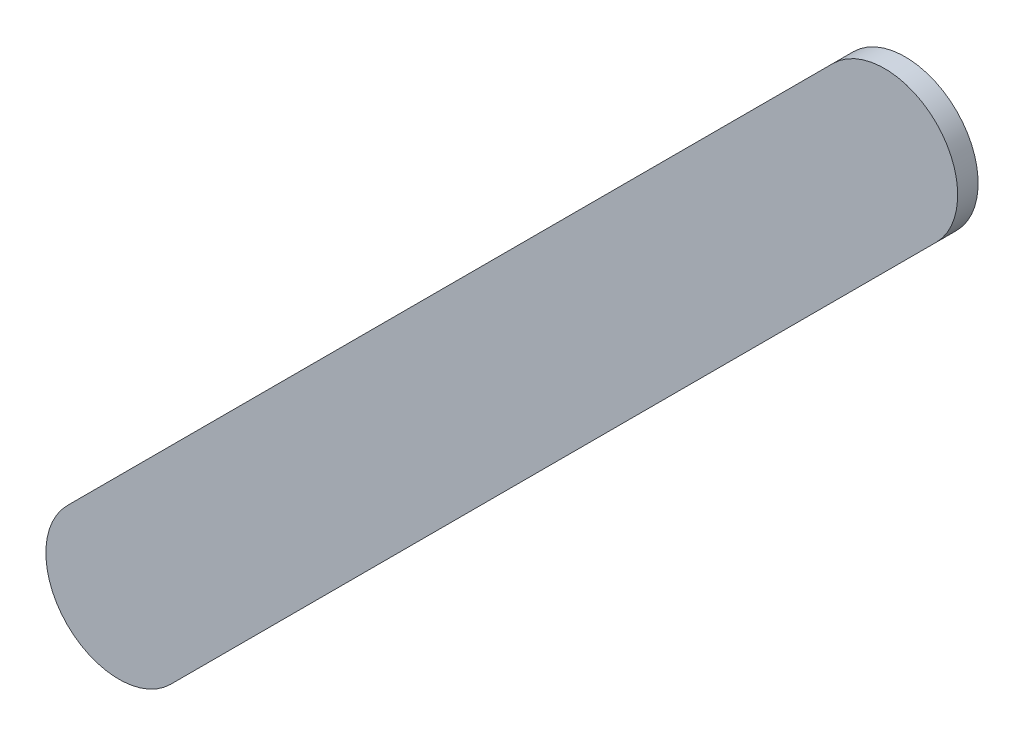
ISO-10303-21;
HEADER;
FILE_DESCRIPTION(('STEP AP214'),'2;1');
FILE_NAME('part.step','',(''),(''),'','','');
FILE_SCHEMA(('AUTOMOTIVE_DESIGN { 1 0 10303 214 1 1 1 1 }'));
ENDSEC;
DATA;
#1=APPLICATION_CONTEXT('core data for automotive mechanical design processes');
#2=APPLICATION_PROTOCOL_DEFINITION('international standard','automotive_design',2000,#1);
#3=PRODUCT_CONTEXT('',#1,'mechanical');
#4=PRODUCT('Part','Part','',(#3));
#5=PRODUCT_RELATED_PRODUCT_CATEGORY('part','',(#4));
#6=PRODUCT_DEFINITION_FORMATION('','',#4);
#7=PRODUCT_DEFINITION_CONTEXT('part definition',#1,'design');
#8=PRODUCT_DEFINITION('design','',#6,#7);
#9=PRODUCT_DEFINITION_SHAPE('','',#8);
#10=(LENGTH_UNIT() NAMED_UNIT(*) SI_UNIT(.MILLI.,.METRE.));
#11=(NAMED_UNIT(*) PLANE_ANGLE_UNIT() SI_UNIT($,.RADIAN.));
#12=(NAMED_UNIT(*) SI_UNIT($,.STERADIAN.) SOLID_ANGLE_UNIT());
#13=UNCERTAINTY_MEASURE_WITH_UNIT(LENGTH_MEASURE(1.E-05),#10,'distance_accuracy_value','');
#14=(GEOMETRIC_REPRESENTATION_CONTEXT(3) GLOBAL_UNCERTAINTY_ASSIGNED_CONTEXT((#13)) GLOBAL_UNIT_ASSIGNED_CONTEXT((#10,
#11,#12)) REPRESENTATION_CONTEXT('',''));
#15=CARTESIAN_POINT('',(0.,0.,0.));
#16=DIRECTION('',(0.,0.,1.));
#17=DIRECTION('',(1.,0.,0.));
#18=AXIS2_PLACEMENT_3D('',#15,#16,#17);
#19=CARTESIAN_POINT('',(90.79977776,71.19017004,0.));
#20=DIRECTION('',(-0.707106781186551,0.707106781186544,0.));
#21=DIRECTION('',(0.707106781186544,0.707106781186551,0.));
#22=AXIS2_PLACEMENT_3D('',#19,#20,#21);
#23=PLANE('',#22);
#24=DIRECTION('',(0.707106781186544,0.707106781186551,0.));
#25=VECTOR('',#24,1.);
#26=CARTESIAN_POINT('',(90.79977776,71.19017004,0.03556));
#27=LINE('',#26,#25);
#28=CARTESIAN_POINT('',(90.79977776,71.19017004,0.03556));
#29=VERTEX_POINT('',#28);
#30=CARTESIAN_POINT('',(92.1317817,72.52217398,0.03556));
#31=VERTEX_POINT('',#30);
#32=EDGE_CURVE('E11',#29,#31,#27,.T.);
#33=ORIENTED_EDGE('',*,*,#32,.F.);
#34=DIRECTION('',(0.,0.,1.));
#35=VECTOR('',#34,1.);
#36=CARTESIAN_POINT('',(90.79977776,71.19017004,0.));
#37=LINE('',#36,#35);
#38=CARTESIAN_POINT('',(90.79977776,71.19017004,0.));
#39=VERTEX_POINT('',#38);
#40=EDGE_CURVE('E24',#39,#29,#37,.T.);
#41=ORIENTED_EDGE('',*,*,#40,.F.);
#42=DIRECTION('',(0.707106781186544,0.707106781186551,0.));
#43=VECTOR('',#42,1.);
#44=CARTESIAN_POINT('',(90.79977776,71.19017004,0.));
#45=LINE('',#44,#43);
#46=CARTESIAN_POINT('',(92.1317817,72.52217398,0.));
#47=VERTEX_POINT('',#46);
#48=EDGE_CURVE('E75',#39,#47,#45,.T.);
#49=ORIENTED_EDGE('',*,*,#48,.T.);
#50=DIRECTION('',(0.,0.,1.));
#51=VECTOR('',#50,1.);
#52=CARTESIAN_POINT('',(92.1317817,72.52217398,0.));
#53=LINE('',#52,#51);
#54=EDGE_CURVE('E37',#47,#31,#53,.T.);
#55=ORIENTED_EDGE('',*,*,#54,.T.);
#56=EDGE_LOOP('',(#33,#41,#49,#55));
#57=FACE_BOUND('',#56,.T.);
#58=ADVANCED_FACE('F17',(#57),#23,.F.);
#59=CARTESIAN_POINT('',(92.04197873,72.61197695,0.));
#60=DIRECTION('',(0.,0.,-1.));
#61=DIRECTION('',(0.707106781186492,-0.707106781186604,0.));
#62=AXIS2_PLACEMENT_3D('',#59,#60,#61);
#63=CYLINDRICAL_SURFACE('',#62,0.127000578115379);
#64=CARTESIAN_POINT('',(92.04197873,72.61197695,0.03556));
#65=DIRECTION('',(0.,0.,1.));
#66=DIRECTION('',(0.707106781186492,-0.707106781186604,0.));
#67=AXIS2_PLACEMENT_3D('',#64,#65,#66);
#68=CIRCLE('',#67,0.127000578115379);
#69=CARTESIAN_POINT('',(91.95217576,72.70177992,0.03556));
#70=VERTEX_POINT('',#69);
#71=EDGE_CURVE('E83',#31,#70,#68,.T.);
#72=ORIENTED_EDGE('',*,*,#71,.F.);
#73=ORIENTED_EDGE('',*,*,#54,.F.);
#74=CARTESIAN_POINT('',(92.04197873,72.61197695,0.));
#75=DIRECTION('',(0.,0.,1.));
#76=DIRECTION('',(0.707106781186492,-0.707106781186604,0.));
#77=AXIS2_PLACEMENT_3D('',#74,#75,#76);
#78=CIRCLE('',#77,0.127000578115379);
#79=CARTESIAN_POINT('',(91.95217576,72.70177992,0.));
#80=VERTEX_POINT('',#79);
#81=EDGE_CURVE('E81',#47,#80,#78,.T.);
#82=ORIENTED_EDGE('',*,*,#81,.T.);
#83=DIRECTION('',(0.,0.,1.));
#84=VECTOR('',#83,1.);
#85=CARTESIAN_POINT('',(91.95217576,72.70177992,0.));
#86=LINE('',#85,#84);
#87=EDGE_CURVE('E67',#80,#70,#86,.T.);
#88=ORIENTED_EDGE('',*,*,#87,.T.);
#89=EDGE_LOOP('',(#72,#73,#82,#88));
#90=FACE_BOUND('',#89,.T.);
#91=ADVANCED_FACE('F89',(#90),#63,.T.);
#92=CARTESIAN_POINT('',(91.95217576,72.70177992,0.));
#93=DIRECTION('',(0.707106781186548,-0.707106781186548,0.));
#94=DIRECTION('',(-0.707106781186548,-0.707106781186548,0.));
#95=AXIS2_PLACEMENT_3D('',#92,#93,#94);
#96=PLANE('',#95);
#97=DIRECTION('',(-0.707106781186548,-0.707106781186548,0.));
#98=VECTOR('',#97,1.);
#99=CARTESIAN_POINT('',(91.95217576,72.70177992,0.03556));
#100=LINE('',#99,#98);
#101=CARTESIAN_POINT('',(90.62017182,71.36977598,0.03556));
#102=VERTEX_POINT('',#101);
#103=EDGE_CURVE('E71',#70,#102,#100,.T.);
#104=ORIENTED_EDGE('',*,*,#103,.F.);
#105=ORIENTED_EDGE('',*,*,#87,.F.);
#106=DIRECTION('',(-0.707106781186548,-0.707106781186548,0.));
#107=VECTOR('',#106,1.);
#108=CARTESIAN_POINT('',(91.95217576,72.70177992,0.));
#109=LINE('',#108,#107);
#110=CARTESIAN_POINT('',(90.62017182,71.36977598,0.));
#111=VERTEX_POINT('',#110);
#112=EDGE_CURVE('E63',#80,#111,#109,.T.);
#113=ORIENTED_EDGE('',*,*,#112,.T.);
#114=DIRECTION('',(0.,0.,1.));
#115=VECTOR('',#114,1.);
#116=CARTESIAN_POINT('',(90.62017182,71.36977598,0.));
#117=LINE('',#116,#115);
#118=EDGE_CURVE('E53',#111,#102,#117,.T.);
#119=ORIENTED_EDGE('',*,*,#118,.T.);
#120=EDGE_LOOP('',(#104,#105,#113,#119));
#121=FACE_BOUND('',#120,.T.);
#122=ADVANCED_FACE('F66',(#121),#96,.F.);
#123=CARTESIAN_POINT('',(90.70997479,71.27997301,0.));
#124=DIRECTION('',(0.,0.,-1.));
#125=DIRECTION('',(-0.707106781186492,0.707106781186604,0.));
#126=AXIS2_PLACEMENT_3D('',#123,#124,#125);
#127=CYLINDRICAL_SURFACE('',#126,0.127000578115382);
#128=CARTESIAN_POINT('',(90.70997479,71.27997301,0.03556));
#129=DIRECTION('',(0.,0.,1.));
#130=DIRECTION('',(-0.707106781186492,0.707106781186604,0.));
#131=AXIS2_PLACEMENT_3D('',#128,#129,#130);
#132=CIRCLE('',#131,0.127000578115382);
#133=EDGE_CURVE('E59',#102,#29,#132,.T.);
#134=ORIENTED_EDGE('',*,*,#133,.F.);
#135=ORIENTED_EDGE('',*,*,#118,.F.);
#136=CARTESIAN_POINT('',(90.70997479,71.27997301,0.));
#137=DIRECTION('',(0.,0.,1.));
#138=DIRECTION('',(-0.707106781186492,0.707106781186604,0.));
#139=AXIS2_PLACEMENT_3D('',#136,#137,#138);
#140=CIRCLE('',#139,0.127000578115382);
#141=EDGE_CURVE('E57',#111,#39,#140,.T.);
#142=ORIENTED_EDGE('',*,*,#141,.T.);
#143=ORIENTED_EDGE('',*,*,#40,.T.);
#144=EDGE_LOOP('',(#134,#135,#142,#143));
#145=FACE_BOUND('',#144,.T.);
#146=ADVANCED_FACE('F55',(#145),#127,.T.);
#147=CARTESIAN_POINT('',(90.79977776,71.19017004,0.));
#148=DIRECTION('',(0.,0.,-1.));
#149=DIRECTION('',(-1.,0.,0.));
#150=AXIS2_PLACEMENT_3D('',#147,#148,#149);
#151=PLANE('',#150);
#152=ORIENTED_EDGE('',*,*,#141,.F.);
#153=ORIENTED_EDGE('',*,*,#112,.F.);
#154=ORIENTED_EDGE('',*,*,#81,.F.);
#155=ORIENTED_EDGE('',*,*,#48,.F.);
#156=EDGE_LOOP('',(#152,#153,#154,#155));
#157=FACE_BOUND('',#156,.T.);
#158=ADVANCED_FACE('F74',(#157),#151,.T.);
#159=CARTESIAN_POINT('',(90.79977776,71.19017004,0.03556));
#160=DIRECTION('',(0.,0.,-1.));
#161=DIRECTION('',(-1.,0.,0.));
#162=AXIS2_PLACEMENT_3D('',#159,#160,#161);
#163=PLANE('',#162);
#164=ORIENTED_EDGE('',*,*,#32,.T.);
#165=ORIENTED_EDGE('',*,*,#71,.T.);
#166=ORIENTED_EDGE('',*,*,#103,.T.);
#167=ORIENTED_EDGE('',*,*,#133,.T.);
#168=EDGE_LOOP('',(#164,#165,#166,#167));
#169=FACE_BOUND('',#168,.T.);
#170=ADVANCED_FACE('F91',(#169),#163,.F.);
#171=CLOSED_SHELL('',(#58,#91,#122,#146,#158,#170));
#172=MANIFOLD_SOLID_BREP('B1',#171);
#173=ADVANCED_BREP_SHAPE_REPRESENTATION('',(#18,#172),#14);
#174=SHAPE_DEFINITION_REPRESENTATION(#9,#173);
ENDSEC;
END-ISO-10303-21;
